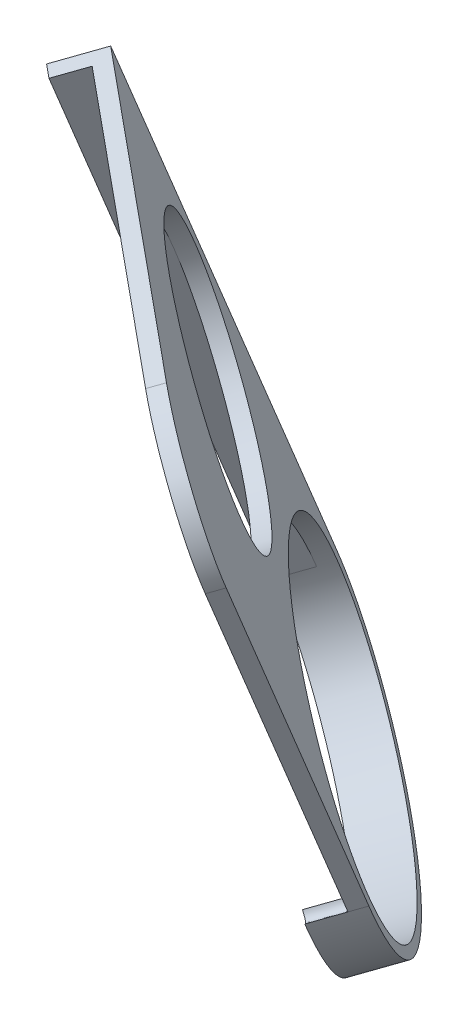
ISO-10303-21;
HEADER;
FILE_DESCRIPTION(('STEP AP214'),'2;1');
FILE_NAME('part.step','',(''),(''),'','','');
FILE_SCHEMA(('AUTOMOTIVE_DESIGN { 1 0 10303 214 1 1 1 1 }'));
ENDSEC;
DATA;
#1=APPLICATION_CONTEXT('core data for automotive mechanical design processes');
#2=APPLICATION_PROTOCOL_DEFINITION('international standard','automotive_design',2000,#1);
#3=PRODUCT_CONTEXT('',#1,'mechanical');
#4=PRODUCT('Part','Part','',(#3));
#5=PRODUCT_RELATED_PRODUCT_CATEGORY('part','',(#4));
#6=PRODUCT_DEFINITION_FORMATION('','',#4);
#7=PRODUCT_DEFINITION_CONTEXT('part definition',#1,'design');
#8=PRODUCT_DEFINITION('design','',#6,#7);
#9=PRODUCT_DEFINITION_SHAPE('','',#8);
#10=(LENGTH_UNIT() NAMED_UNIT(*) SI_UNIT(.MILLI.,.METRE.));
#11=(NAMED_UNIT(*) PLANE_ANGLE_UNIT() SI_UNIT($,.RADIAN.));
#12=(NAMED_UNIT(*) SI_UNIT($,.STERADIAN.) SOLID_ANGLE_UNIT());
#13=UNCERTAINTY_MEASURE_WITH_UNIT(LENGTH_MEASURE(1.E-05),#10,'distance_accuracy_value','');
#14=(GEOMETRIC_REPRESENTATION_CONTEXT(3) GLOBAL_UNCERTAINTY_ASSIGNED_CONTEXT((#13)) GLOBAL_UNIT_ASSIGNED_CONTEXT((#10,
#11,#12)) REPRESENTATION_CONTEXT('',''));
#15=CARTESIAN_POINT('',(0.,0.,0.));
#16=DIRECTION('',(0.,0.,1.));
#17=DIRECTION('',(1.,0.,0.));
#18=AXIS2_PLACEMENT_3D('',#15,#16,#17);
#19=CARTESIAN_POINT('',(0.610551012978078,22.4707846704043,84.2965376580732));
#20=DIRECTION('',(-0.639892762049815,-0.292371746682194,0.710672930973357));
#21=DIRECTION('',(-0.646396425501904,-0.295343318726906,-0.703522554849337));
#22=AXIS2_PLACEMENT_3D('',#19,#20,#21);
#23=ELLIPSE('',#22,22.1620944932128,15.75000065);
#24=DIRECTION('',(0.639892762049815,0.292371746682194,-0.710672930973357));
#25=VECTOR('',#24,1.);
#26=SURFACE_OF_LINEAR_EXTRUSION('',#23,#25);
#27=CARTESIAN_POINT('',(1.5703901560528,22.9093422904276,83.2305282616131));
#28=DIRECTION('',(-0.639892762049815,-0.292371746682194,0.710672930973357));
#29=DIRECTION('',(-0.646396425501904,-0.295343318726906,-0.703522554849337));
#30=AXIS2_PLACEMENT_3D('',#27,#28,#29);
#31=ELLIPSE('',#30,22.1620944932128,15.75000065);
#32=CARTESIAN_POINT('',(-14.1796104939472,22.9093412576584,69.0491639786596));
#33=VERTEX_POINT('',#32);
#34=CARTESIAN_POINT('',(17.3203908060528,22.9093433231969,97.4118925445666));
#35=VERTEX_POINT('',#34);
#36=EDGE_CURVE('E198',#33,#35,#31,.T.);
#37=ORIENTED_EDGE('',*,*,#36,.T.);
#38=DIRECTION('',(0.639892762049815,0.292371746682194,-0.710672930973357));
#39=VECTOR('',#38,1.);
#40=CARTESIAN_POINT('',(16.3605516629781,22.4707857031736,98.4779019410266));
#41=LINE('',#40,#39);
#42=CARTESIAN_POINT('',(16.360551662978,22.4707857031736,98.4779019410267));
#43=VERTEX_POINT('',#42);
#44=EDGE_CURVE('E211',#43,#35,#41,.T.);
#45=ORIENTED_EDGE('',*,*,#44,.F.);
#46=DIRECTION('',(0.639892762049815,0.292371746682194,-0.710672930973356));
#47=VECTOR('',#46,1.);
#48=CARTESIAN_POINT('',(14.3768841006236,21.5644332884588,100.680988027044));
#49=LINE('',#48,#47);
#50=CARTESIAN_POINT('',(14.3768841006236,21.5644332884588,100.680988027044));
#51=VERTEX_POINT('',#50);
#52=EDGE_CURVE('E118',#51,#43,#49,.T.);
#53=ORIENTED_EDGE('',*,*,#52,.F.);
#54=CARTESIAN_POINT('',(-1.37311654937637,21.5644322556895,86.4996237440906));
#55=DIRECTION('',(-0.639892762049815,-0.292371746682194,0.710672930973357));
#56=DIRECTION('',(-0.646396425501904,-0.295343318726906,-0.703522554849337));
#57=AXIS2_PLACEMENT_3D('',#54,#55,#56);
#58=ELLIPSE('',#57,22.1620944932128,15.75000065);
#59=CARTESIAN_POINT('',(-17.1231171993764,21.5644312229203,72.3182594611371));
#60=VERTEX_POINT('',#59);
#61=EDGE_CURVE('E140',#60,#51,#58,.T.);
#62=ORIENTED_EDGE('',*,*,#61,.F.);
#63=DIRECTION('',(0.639892762049815,0.292371746682194,-0.710672930973357));
#64=VECTOR('',#63,1.);
#65=CARTESIAN_POINT('',(-15.1394496370219,22.4707836376351,70.1151733751197));
#66=LINE('',#65,#64);
#67=EDGE_CURVE('E192',#60,#33,#66,.T.);
#68=ORIENTED_EDGE('',*,*,#67,.T.);
#69=EDGE_LOOP('',(#37,#45,#53,#62,#68));
#70=FACE_BOUND('',#69,.T.);
#71=ADVANCED_FACE('F38',(#70),#26,.F.);
#72=CARTESIAN_POINT('',(16.3605551952176,-31.3967885953475,76.3167166185939));
#73=DIRECTION('',(0.768464217173614,-0.243455068261987,0.591770543928385));
#74=DIRECTION('',(0.610127966621738,0.,-0.792302886745987));
#75=AXIS2_PLACEMENT_3D('',#72,#73,#74);
#76=PLANE('',#75);
#77=DIRECTION('',(6.06413494632769E-08,-0.924796405420974,-0.380462361503003));
#78=VECTOR('',#77,1.);
#79=CARTESIAN_POINT('',(17.3203943382923,-30.9582309753242,75.2507072221339));
#80=LINE('',#79,#78);
#81=CARTESIAN_POINT('',(17.3203886015871,56.5280205006919,111.242657061579));
#82=VERTEX_POINT('',#81);
#83=EDGE_CURVE('E201',#82,#35,#80,.T.);
#84=ORIENTED_EDGE('',*,*,#83,.F.);
#85=DIRECTION('',(0.639892762049815,0.292371746682194,-0.710672930973357));
#86=VECTOR('',#85,1.);
#87=CARTESIAN_POINT('',(16.3605494585124,56.0894628806686,112.308666458039));
#88=LINE('',#87,#86);
#89=CARTESIAN_POINT('',(16.3605494585123,56.0894628806686,112.308666458039));
#90=VERTEX_POINT('',#89);
#91=EDGE_CURVE('E46',#82,#90,#88,.F.);
#92=ORIENTED_EDGE('',*,*,#91,.T.);
#93=DIRECTION('',(6.06413494632769E-08,-0.924796405420974,-0.380462361503003));
#94=VECTOR('',#93,1.);
#95=CARTESIAN_POINT('',(16.3605551952176,-31.3967885953475,76.3167166185939));
#96=LINE('',#95,#94);
#97=EDGE_CURVE('E188',#90,#43,#96,.T.);
#98=ORIENTED_EDGE('',*,*,#97,.T.);
#99=ORIENTED_EDGE('',*,*,#44,.T.);
#100=EDGE_LOOP('',(#84,#92,#98,#99));
#101=FACE_BOUND('',#100,.T.);
#102=ADVANCED_FACE('F175',(#101),#76,.T.);
#103=CARTESIAN_POINT('',(-33.8802534253904,81.6119756943352,77.5716399047425));
#104=DIRECTION('',(-6.0641348749504E-08,0.924796405420974,0.380462361503004));
#105=DIRECTION('',(0.,-0.380462361503004,0.924796405420976));
#106=AXIS2_PLACEMENT_3D('',#103,#104,#105);
#107=PLANE('',#106);
#108=DIRECTION('',(0.768464217173614,-0.243455068261987,0.591770543928385));
#109=VECTOR('',#108,1.);
#110=CARTESIAN_POINT('',(-33.8802534253904,81.6119756943352,77.5716399047425));
#111=LINE('',#110,#109);
#112=CARTESIAN_POINT('',(-14.1394531049732,75.3579461869761,92.7734201335748));
#113=VERTEX_POINT('',#112);
#114=CARTESIAN_POINT('',(8.37851100484832,68.2240909378136,110.113808367186));
#115=VERTEX_POINT('',#114);
#116=EDGE_CURVE('E190',#113,#115,#111,.T.);
#117=ORIENTED_EDGE('',*,*,#116,.T.);
#118=DIRECTION('',(0.639892762049815,0.292371746682194,-0.710672930973357));
#119=VECTOR('',#118,1.);
#120=CARTESIAN_POINT('',(8.37851100484832,68.2240909378136,110.113808367186));
#121=LINE('',#120,#119);
#122=CARTESIAN_POINT('',(9.33835014792304,68.6626485578368,109.047798970726));
#123=VERTEX_POINT('',#122);
#124=EDGE_CURVE('E216',#115,#123,#121,.T.);
#125=ORIENTED_EDGE('',*,*,#124,.T.);
#126=DIRECTION('',(0.768464217173614,-0.243455068261987,0.591770543928385));
#127=VECTOR('',#126,1.);
#128=CARTESIAN_POINT('',(-32.9204142823156,82.0505333143585,76.5056305082825));
#129=LINE('',#128,#127);
#130=CARTESIAN_POINT('',(-14.1796139826724,76.113311106388,90.9373416265473));
#131=VERTEX_POINT('',#130);
#132=EDGE_CURVE('E203',#131,#123,#129,.T.);
#133=ORIENTED_EDGE('',*,*,#132,.F.);
#134=DIRECTION('',(0.639892762049815,0.292371746682194,-0.710672930973357));
#135=VECTOR('',#134,1.);
#136=CARTESIAN_POINT('',(-15.1394531257471,75.6747534863647,92.0033510230074));
#137=LINE('',#136,#135);
#138=CARTESIAN_POINT('',(-17.1231206881016,74.7684010716499,94.2064371090248));
#139=VERTEX_POINT('',#138);
#140=EDGE_CURVE('E124',#139,#131,#137,.T.);
#141=ORIENTED_EDGE('',*,*,#140,.F.);
#142=DIRECTION('',(-0.768464217173614,0.243455068261987,-0.591770543928385));
#143=VECTOR('',#142,1.);
#144=CARTESIAN_POINT('',(-35.8639209877448,80.7056232796204,79.77472599076));
#145=LINE('',#144,#143);
#146=CARTESIAN_POINT('',(-16.1231206673277,74.4515937722613,94.9765062195922));
#147=VERTEX_POINT('',#146);
#148=EDGE_CURVE('E121',#147,#139,#145,.T.);
#149=ORIENTED_EDGE('',*,*,#148,.F.);
#150=DIRECTION('',(0.639892762049815,0.292371746682194,-0.710672930973356));
#151=VECTOR('',#150,1.);
#152=CARTESIAN_POINT('',(-16.1231206673277,74.4515937722613,94.9765062195922));
#153=LINE('',#152,#151);
#154=EDGE_CURVE('E107',#147,#113,#153,.T.);
#155=ORIENTED_EDGE('',*,*,#154,.T.);
#156=EDGE_LOOP('',(#117,#125,#133,#141,#149,#155));
#157=FACE_BOUND('',#156,.T.);
#158=ADVANCED_FACE('F122',(#157),#107,.T.);
#159=CARTESIAN_POINT('',(0.610551012978078,22.4707846704043,84.2965376580732));
#160=DIRECTION('',(-0.639892762049815,-0.292371746682194,0.710672930973357));
#161=DIRECTION('',(-0.646396425501904,-0.295343318726906,-0.703522554849337));
#162=AXIS2_PLACEMENT_3D('',#159,#160,#161);
#163=ELLIPSE('',#162,20.7549774406041,14.75000065);
#164=DIRECTION('',(0.639892762049815,0.292371746682194,-0.710672930973357));
#165=VECTOR('',#164,1.);
#166=SURFACE_OF_LINEAR_EXTRUSION('',#163,#165);
#167=CARTESIAN_POINT('',(15.3571256239841,22.7886783901195,97.7051945597105));
#168=VERTEX_POINT('',#167);
#169=CARTESIAN_POINT('',(-14.1394498009701,22.4707838465966,71.0155773307883));
#170=VERTEX_POINT('',#169);
#171=EDGE_CURVE('E185',#168,#170,#163,.T.);
#172=ORIENTED_EDGE('',*,*,#171,.T.);
#173=DIRECTION('',(0.639892762049815,0.292371746682194,-0.710672930973356));
#174=VECTOR('',#173,1.);
#175=CARTESIAN_POINT('',(-16.1231173633245,21.5644314318818,73.2186634168057));
#176=LINE('',#175,#174);
#177=CARTESIAN_POINT('',(-16.1231173633245,21.5644314318818,73.2186634168057));
#178=VERTEX_POINT('',#177);
#179=EDGE_CURVE('E236',#178,#170,#176,.T.);
#180=ORIENTED_EDGE('',*,*,#179,.F.);
#181=CARTESIAN_POINT('',(-1.37311654937636,21.5644322556895,86.4996237440906));
#182=DIRECTION('',(0.639892762049815,0.292371746682194,-0.710672930973357));
#183=DIRECTION('',(-0.646396425501904,-0.295343318726906,-0.703522554849337));
#184=AXIS2_PLACEMENT_3D('',#181,#182,#183);
#185=ELLIPSE('',#184,20.7549774406041,14.75000065);
#186=CARTESIAN_POINT('',(13.3734580616296,21.8823259754047,99.9082806457279));
#187=VERTEX_POINT('',#186);
#188=EDGE_CURVE('E132',#187,#178,#185,.T.);
#189=ORIENTED_EDGE('',*,*,#188,.F.);
#190=DIRECTION('',(0.639892762049815,0.292371746682194,-0.710672930973356));
#191=VECTOR('',#190,1.);
#192=CARTESIAN_POINT('',(13.3734580616296,21.8823259754047,99.9082806457279));
#193=LINE('',#192,#191);
#194=EDGE_CURVE('E230',#187,#168,#193,.T.);
#195=ORIENTED_EDGE('',*,*,#194,.T.);
#196=EDGE_LOOP('',(#172,#180,#189,#195));
#197=FACE_BOUND('',#196,.T.);
#198=CARTESIAN_POINT('',(1.5703901560528,22.9093422904276,83.2305282616131));
#199=DIRECTION('',(-0.639892762049815,-0.292371746682194,0.710672930973357));
#200=DIRECTION('',(-0.646396425501904,-0.295343318726906,-0.703522554849337));
#201=AXIS2_PLACEMENT_3D('',#198,#199,#200);
#202=ELLIPSE('',#201,20.7549774406041,14.75000065);
#203=CARTESIAN_POINT('',(-11.8455530729263,16.7794983730175,68.628933506759));
#204=VERTEX_POINT('',#203);
#205=EDGE_CURVE('E195',#204,#204,#202,.T.);
#206=ORIENTED_EDGE('',*,*,#205,.F.);
#207=EDGE_LOOP('',(#206));
#208=FACE_BOUND('',#207,.T.);
#209=ADVANCED_FACE('F174',(#197,#208),#166,.T.);
#210=CARTESIAN_POINT('',(-4.53364912289882,52.9865129604029,92.2188885772668));
#211=DIRECTION('',(0.639892762049815,0.292371746682194,-0.710672930973357));
#212=DIRECTION('',(-0.743144835446272,0.,-0.669130595287297));
#213=AXIS2_PLACEMENT_3D('',#210,#211,#212);
#214=CYLINDRICAL_SURFACE('',#213,12.5);
#215=CARTESIAN_POINT('',(-4.53364912289882,52.9865129604029,92.2188885772668));
#216=DIRECTION('',(-0.639892762049815,-0.292371746682194,0.710672930973357));
#217=DIRECTION('',(0.743144835446272,0.,0.669130595287297));
#218=AXIS2_PLACEMENT_3D('',#215,#216,#217);
#219=CIRCLE('',#218,12.5);
#220=CARTESIAN_POINT('',(-14.1394519574027,56.0297014378931,84.8217567213657));
#221=VERTEX_POINT('',#220);
#222=EDGE_CURVE('E208',#221,#221,#219,.T.);
#223=ORIENTED_EDGE('',*,*,#222,.T.);
#224=EDGE_LOOP('',(#223));
#225=FACE_BOUND('',#224,.T.);
#226=CARTESIAN_POINT('',(-3.57380997982409,53.4250705804262,91.1528791808068));
#227=DIRECTION('',(-0.639892762049815,-0.292371746682194,0.710672930973357));
#228=DIRECTION('',(0.743144835446272,0.,0.669130595287297));
#229=AXIS2_PLACEMENT_3D('',#226,#227,#228);
#230=CIRCLE('',#229,12.5);
#231=CARTESIAN_POINT('',(5.71550046325432,53.4250705804262,99.517011621898));
#232=VERTEX_POINT('',#231);
#233=EDGE_CURVE('E117',#232,#232,#230,.T.);
#234=ORIENTED_EDGE('',*,*,#233,.F.);
#235=EDGE_LOOP('',(#234));
#236=FACE_BOUND('',#235,.T.);
#237=ADVANCED_FACE('F170',(#225,#236),#214,.F.);
#238=CARTESIAN_POINT('',(-15.1394467591602,-21.4173582527592,52.0595386346307));
#239=DIRECTION('',(-0.768464217173614,0.243455068261986,-0.591770543928385));
#240=DIRECTION('',(-0.610127966621737,0.,0.792302886745987));
#241=AXIS2_PLACEMENT_3D('',#238,#239,#240);
#242=PLANE('',#241);
#243=DIRECTION('',(-6.06413494568505E-08,0.924796405420974,0.380462361503003));
#244=VECTOR('',#243,1.);
#245=CARTESIAN_POINT('',(-14.1796076160855,-20.9788006327359,50.9935292381706));
#246=LINE('',#245,#244);
#247=EDGE_CURVE('E205',#33,#131,#246,.T.);
#248=ORIENTED_EDGE('',*,*,#247,.F.);
#249=ORIENTED_EDGE('',*,*,#67,.F.);
#250=DIRECTION('',(6.06413495252145E-08,-0.924796405420974,-0.380462361503003));
#251=VECTOR('',#250,1.);
#252=CARTESIAN_POINT('',(-17.1231143215146,-22.323710667474,54.2626247206481));
#253=LINE('',#252,#251);
#254=EDGE_CURVE('E128',#139,#60,#253,.T.);
#255=ORIENTED_EDGE('',*,*,#254,.F.);
#256=ORIENTED_EDGE('',*,*,#140,.T.);
#257=EDGE_LOOP('',(#248,#249,#255,#256));
#258=FACE_BOUND('',#257,.T.);
#259=ADVANCED_FACE('F163',(#258),#242,.T.);
#260=CARTESIAN_POINT('',(-33.8802470588035,-15.4801360447886,37.6278275163658));
#261=DIRECTION('',(-0.639892762049815,-0.292371746682194,0.710672930973357));
#262=DIRECTION('',(0.743144835446272,0.,0.669130595287297));
#263=AXIS2_PLACEMENT_3D('',#260,#261,#262);
#264=PLANE('',#263);
#265=ORIENTED_EDGE('',*,*,#97,.F.);
#266=CARTESIAN_POINT('',(8.37851163473002,58.6182306747059,106.161945818255));
#267=DIRECTION('',(-0.639892762049815,-0.292371746682194,0.710672930973357));
#268=DIRECTION('',(0.743144835446272,0.,0.669130595287297));
#269=AXIS2_PLACEMENT_3D('',#266,#267,#268);
#270=CIRCLE('',#269,10.387);
#271=EDGE_CURVE('E11',#90,#115,#270,.T.);
#272=ORIENTED_EDGE('',*,*,#271,.T.);
#273=ORIENTED_EDGE('',*,*,#116,.F.);
#274=DIRECTION('',(5.49076818379184E-08,-0.924796403604506,-0.380462365918324));
#275=VECTOR('',#274,1.);
#276=CARTESIAN_POINT('',(-14.13944734035,-21.7341655386952,52.8296072087219));
#277=LINE('',#276,#275);
#278=EDGE_CURVE('E113',#113,#221,#277,.T.);
#279=ORIENTED_EDGE('',*,*,#278,.T.);
#280=ORIENTED_EDGE('',*,*,#222,.F.);
#281=DIRECTION('',(-5.4907681791512E-08,0.924796403604506,0.380462365918324));
#282=VECTOR('',#281,1.);
#283=CARTESIAN_POINT('',(-14.13944734035,-21.7341655386952,52.8296072087219));
#284=LINE('',#283,#282);
#285=EDGE_CURVE('E214',#170,#221,#284,.T.);
#286=ORIENTED_EDGE('',*,*,#285,.F.);
#287=ORIENTED_EDGE('',*,*,#171,.F.);
#288=CARTESIAN_POINT('',(16.360551662978,22.4707857031736,98.4779019410267));
#289=CARTESIAN_POINT('',(15.8819062159062,21.7144291540703,97.7357616123908));
#290=CARTESIAN_POINT('',(15.357125623984,22.7886783901195,97.7051945597105));
#291=B_SPLINE_CURVE_WITH_KNOTS('',2,(#288,#289,#290),.UNSPECIFIED.,.F.,.F.,(3,3),(0.,1.),.UNSPECIFIED.);
#292=EDGE_CURVE('E134',#43,#168,#291,.T.);
#293=ORIENTED_EDGE('',*,*,#292,.F.);
#294=EDGE_LOOP('',(#265,#272,#273,#279,#280,#286,#287,#293));
#295=FACE_BOUND('',#294,.T.);
#296=ADVANCED_FACE('F160',(#295),#264,.T.);
#297=CARTESIAN_POINT('',(-32.9204079157288,-15.0415784247653,36.5618181199058));
#298=DIRECTION('',(-0.639892762049815,-0.292371746682194,0.710672930973357));
#299=DIRECTION('',(0.743144835446272,0.,0.669130595287297));
#300=AXIS2_PLACEMENT_3D('',#297,#298,#299);
#301=PLANE('',#300);
#302=ORIENTED_EDGE('',*,*,#233,.T.);
#303=EDGE_LOOP('',(#302));
#304=FACE_BOUND('',#303,.T.);
#305=ORIENTED_EDGE('',*,*,#205,.T.);
#306=EDGE_LOOP('',(#305));
#307=FACE_BOUND('',#306,.T.);
#308=ORIENTED_EDGE('',*,*,#132,.T.);
#309=CARTESIAN_POINT('',(9.33835077780474,59.0567882947292,105.095936421795));
#310=DIRECTION('',(-0.639892762049815,-0.292371746682194,0.710672930973357));
#311=DIRECTION('',(0.743144835446272,0.,0.669130595287297));
#312=AXIS2_PLACEMENT_3D('',#309,#310,#311);
#313=CIRCLE('',#312,10.387);
#314=EDGE_CURVE('E60',#123,#82,#313,.F.);
#315=ORIENTED_EDGE('',*,*,#314,.T.);
#316=ORIENTED_EDGE('',*,*,#83,.T.);
#317=ORIENTED_EDGE('',*,*,#36,.F.);
#318=ORIENTED_EDGE('',*,*,#247,.T.);
#319=EDGE_LOOP('',(#308,#315,#316,#317,#318));
#320=FACE_BOUND('',#319,.T.);
#321=ADVANCED_FACE('F159',(#304,#307,#320),#301,.F.);
#322=CARTESIAN_POINT('',(-16.1231149027045,-22.64051795341,55.0326932947393));
#323=DIRECTION('',(0.768464217173614,-0.24345507516208,0.591770541089678));
#324=DIRECTION('',(0.610127964784477,0.,-0.792302888160804));
#325=AXIS2_PLACEMENT_3D('',#322,#323,#324);
#326=PLANE('',#325);
#327=ORIENTED_EDGE('',*,*,#278,.F.);
#328=ORIENTED_EDGE('',*,*,#154,.F.);
#329=DIRECTION('',(5.49076818379184E-08,-0.924796403604506,-0.380462365918324));
#330=VECTOR('',#329,1.);
#331=CARTESIAN_POINT('',(-16.1231149027045,-22.64051795341,55.0326932947393));
#332=LINE('',#331,#330);
#333=EDGE_CURVE('E111',#147,#178,#332,.T.);
#334=ORIENTED_EDGE('',*,*,#333,.T.);
#335=ORIENTED_EDGE('',*,*,#179,.T.);
#336=ORIENTED_EDGE('',*,*,#285,.T.);
#337=EDGE_LOOP('',(#327,#328,#334,#335,#336));
#338=FACE_BOUND('',#337,.T.);
#339=ADVANCED_FACE('F109',(#338),#326,.T.);
#340=CARTESIAN_POINT('',(14.3768841006236,21.5644332884588,100.680988027044));
#341=CARTESIAN_POINT('',(13.8982386535518,20.8080767393555,99.9388476984082));
#342=CARTESIAN_POINT('',(13.3734580616296,21.8823259754047,99.9082806457279));
#343=B_SPLINE_CURVE_WITH_KNOTS('',2,(#340,#341,#342),.UNSPECIFIED.,.F.,.F.,(3,3),(0.,1.),.UNSPECIFIED.);
#344=DIRECTION('',(0.639892762049815,0.292371746682194,-0.710672930973356));
#345=VECTOR('',#344,1.);
#346=SURFACE_OF_LINEAR_EXTRUSION('',#343,#345);
#347=ORIENTED_EDGE('',*,*,#292,.T.);
#348=ORIENTED_EDGE('',*,*,#194,.F.);
#349=EDGE_CURVE('E142',#51,#187,#343,.T.);
#350=ORIENTED_EDGE('',*,*,#349,.F.);
#351=ORIENTED_EDGE('',*,*,#52,.T.);
#352=EDGE_LOOP('',(#347,#348,#350,#351));
#353=FACE_BOUND('',#352,.T.);
#354=ADVANCED_FACE('F152',(#353),#346,.F.);
#355=CARTESIAN_POINT('',(-35.863914621158,-16.3864884595034,39.8309136023832));
#356=DIRECTION('',(-0.639892762049815,-0.292371746682194,0.710672930973356));
#357=DIRECTION('',(0.743144835446272,0.,0.669130595287298));
#358=AXIS2_PLACEMENT_3D('',#355,#356,#357);
#359=PLANE('',#358);
#360=ORIENTED_EDGE('',*,*,#333,.F.);
#361=ORIENTED_EDGE('',*,*,#148,.T.);
#362=ORIENTED_EDGE('',*,*,#254,.T.);
#363=ORIENTED_EDGE('',*,*,#61,.T.);
#364=ORIENTED_EDGE('',*,*,#349,.T.);
#365=ORIENTED_EDGE('',*,*,#188,.T.);
#366=EDGE_LOOP('',(#360,#361,#362,#363,#364,#365));
#367=FACE_BOUND('',#366,.T.);
#368=ADVANCED_FACE('F130',(#367),#359,.T.);
#369=CARTESIAN_POINT('',(8.37851163473002,58.6182306747059,106.161945818255));
#370=DIRECTION('',(0.639892762049815,0.292371746682194,-0.710672930973357));
#371=DIRECTION('',(-0.743144835446272,0.,-0.669130595287297));
#372=AXIS2_PLACEMENT_3D('',#369,#370,#371);
#373=CYLINDRICAL_SURFACE('',#372,10.387);
#374=ORIENTED_EDGE('',*,*,#271,.F.);
#375=ORIENTED_EDGE('',*,*,#91,.F.);
#376=ORIENTED_EDGE('',*,*,#314,.F.);
#377=ORIENTED_EDGE('',*,*,#124,.F.);
#378=EDGE_LOOP('',(#374,#375,#376,#377));
#379=FACE_BOUND('',#378,.T.);
#380=ADVANCED_FACE('F40',(#379),#373,.T.);
#381=CLOSED_SHELL('',(#71,#102,#158,#209,#237,#259,#296,#321,#339,#354,#368,#380));
#382=MANIFOLD_SOLID_BREP('B2',#381);
#383=ADVANCED_BREP_SHAPE_REPRESENTATION('',(#18,#382),#14);
#384=SHAPE_DEFINITION_REPRESENTATION(#9,#383);
ENDSEC;
END-ISO-10303-21;
